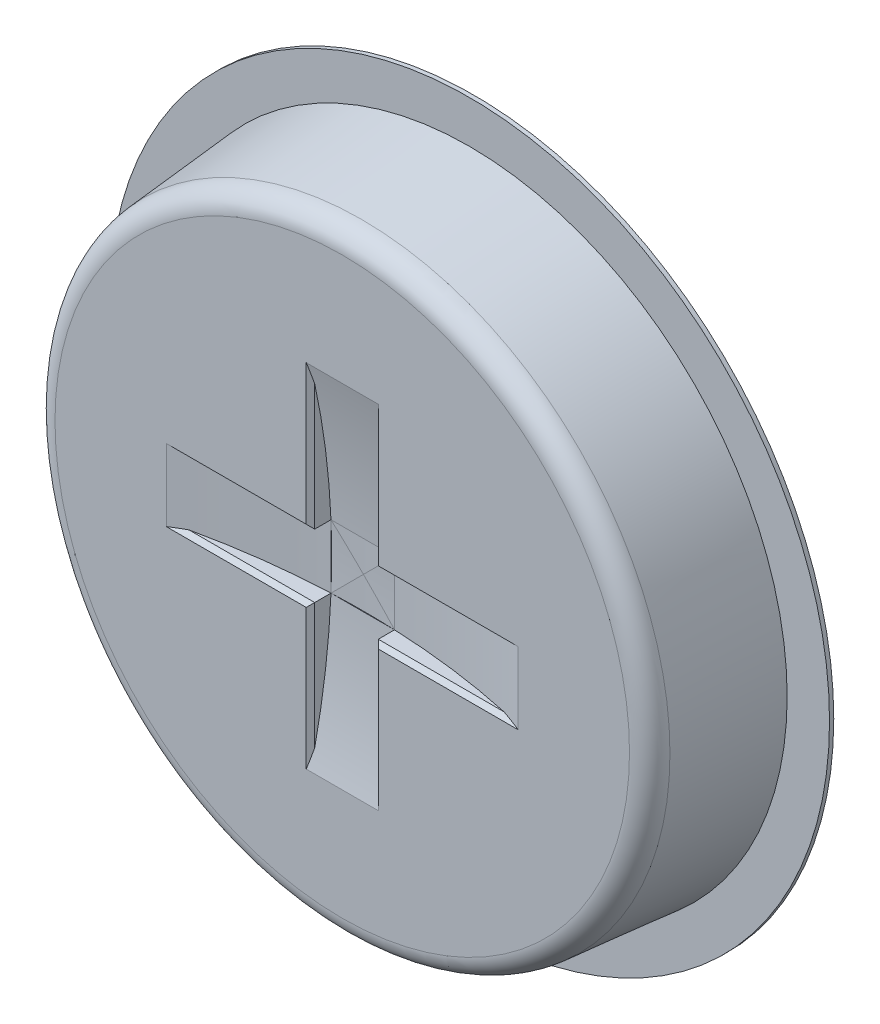
ISO-10303-21;
HEADER;
FILE_DESCRIPTION(('STEP AP214'),'2;1');
FILE_NAME('part.step','',(''),(''),'','','');
FILE_SCHEMA(('AUTOMOTIVE_DESIGN { 1 0 10303 214 1 1 1 1 }'));
ENDSEC;
DATA;
#1=APPLICATION_CONTEXT('core data for automotive mechanical design processes');
#2=APPLICATION_PROTOCOL_DEFINITION('international standard','automotive_design',2000,#1);
#3=PRODUCT_CONTEXT('',#1,'mechanical');
#4=PRODUCT('Part','Part','',(#3));
#5=PRODUCT_RELATED_PRODUCT_CATEGORY('part','',(#4));
#6=PRODUCT_DEFINITION_FORMATION('','',#4);
#7=PRODUCT_DEFINITION_CONTEXT('part definition',#1,'design');
#8=PRODUCT_DEFINITION('design','',#6,#7);
#9=PRODUCT_DEFINITION_SHAPE('','',#8);
#10=(LENGTH_UNIT() NAMED_UNIT(*) SI_UNIT(.MILLI.,.METRE.));
#11=(NAMED_UNIT(*) PLANE_ANGLE_UNIT() SI_UNIT($,.RADIAN.));
#12=(NAMED_UNIT(*) SI_UNIT($,.STERADIAN.) SOLID_ANGLE_UNIT());
#13=UNCERTAINTY_MEASURE_WITH_UNIT(LENGTH_MEASURE(1.E-05),#10,'distance_accuracy_value','');
#14=(GEOMETRIC_REPRESENTATION_CONTEXT(3) GLOBAL_UNCERTAINTY_ASSIGNED_CONTEXT((#13)) GLOBAL_UNIT_ASSIGNED_CONTEXT((#10,
#11,#12)) REPRESENTATION_CONTEXT('',''));
#15=CARTESIAN_POINT('',(0.,0.,0.));
#16=DIRECTION('',(0.,0.,1.));
#17=DIRECTION('',(1.,0.,0.));
#18=AXIS2_PLACEMENT_3D('',#15,#16,#17);
#19=CARTESIAN_POINT('',(0.,0.,60.));
#20=DIRECTION('',(0.,0.,1.));
#21=DIRECTION('',(1.,0.,0.));
#22=AXIS2_PLACEMENT_3D('',#19,#20,#21);
#23=PLANE('',#22);
#24=CARTESIAN_POINT('',(0.,0.,60.));
#25=DIRECTION('',(0.,0.,1.));
#26=DIRECTION('',(1.,0.,0.));
#27=AXIS2_PLACEMENT_3D('',#24,#25,#26);
#28=CIRCLE('',#27,135.58736844827);
#29=CARTESIAN_POINT('',(135.58736844827,0.,60.));
#30=VERTEX_POINT('',#29);
#31=EDGE_CURVE('E215',#30,#30,#28,.T.);
#32=ORIENTED_EDGE('',*,*,#31,.T.);
#33=EDGE_LOOP('',(#32));
#34=FACE_BOUND('',#33,.T.);
#35=DIRECTION('',(-1.,0.,0.));
#36=VECTOR('',#35,1.);
#37=CARTESIAN_POINT('',(15.0000000000003,-83.0662386291807,60.));
#38=LINE('',#37,#36);
#39=CARTESIAN_POINT('',(-16.9999999999997,-83.0662386291808,60.));
#40=VERTEX_POINT('',#39);
#41=CARTESIAN_POINT('',(17.0000000000003,-83.0662386291807,60.));
#42=VERTEX_POINT('',#41);
#43=EDGE_CURVE('E314',#40,#42,#38,.F.);
#44=ORIENTED_EDGE('',*,*,#43,.F.);
#45=DIRECTION('',(0.,1.,0.));
#46=VECTOR('',#45,1.);
#47=CARTESIAN_POINT('',(-17.,-15.,60.));
#48=LINE('',#47,#46);
#49=CARTESIAN_POINT('',(-16.9999999999999,-17.,60.));
#50=VERTEX_POINT('',#49);
#51=EDGE_CURVE('E246',#40,#50,#48,.T.);
#52=ORIENTED_EDGE('',*,*,#51,.T.);
#53=DIRECTION('',(-1.,0.,0.));
#54=VECTOR('',#53,1.);
#55=CARTESIAN_POINT('',(0.,-17.,60.));
#56=LINE('',#55,#54);
#57=CARTESIAN_POINT('',(-83.0662386291808,-17.,60.));
#58=VERTEX_POINT('',#57);
#59=EDGE_CURVE('E243',#50,#58,#56,.T.);
#60=ORIENTED_EDGE('',*,*,#59,.T.);
#61=DIRECTION('',(0.,1.,0.));
#62=VECTOR('',#61,1.);
#63=CARTESIAN_POINT('',(-83.0662386291808,-15.,60.));
#64=LINE('',#63,#62);
#65=CARTESIAN_POINT('',(-83.0662386291808,17.,60.));
#66=VERTEX_POINT('',#65);
#67=EDGE_CURVE('E318',#66,#58,#64,.F.);
#68=ORIENTED_EDGE('',*,*,#67,.F.);
#69=DIRECTION('',(1.,0.,0.));
#70=VECTOR('',#69,1.);
#71=CARTESIAN_POINT('',(-15.0000000000001,17.,60.));
#72=LINE('',#71,#70);
#73=CARTESIAN_POINT('',(-17.0000000000001,17.,60.));
#74=VERTEX_POINT('',#73);
#75=EDGE_CURVE('E241',#66,#74,#72,.T.);
#76=ORIENTED_EDGE('',*,*,#75,.T.);
#77=DIRECTION('',(0.,1.,0.));
#78=VECTOR('',#77,1.);
#79=CARTESIAN_POINT('',(-17.0000000000003,83.0662386291807,60.));
#80=LINE('',#79,#78);
#81=CARTESIAN_POINT('',(-17.0000000000003,83.0662386291807,60.));
#82=VERTEX_POINT('',#81);
#83=EDGE_CURVE('E238',#74,#82,#80,.T.);
#84=ORIENTED_EDGE('',*,*,#83,.T.);
#85=DIRECTION('',(-1.,0.,0.));
#86=VECTOR('',#85,1.);
#87=CARTESIAN_POINT('',(14.9999999999997,83.0662386291808,60.));
#88=LINE('',#87,#86);
#89=CARTESIAN_POINT('',(16.9999999999997,83.0662386291808,60.));
#90=VERTEX_POINT('',#89);
#91=EDGE_CURVE('E170',#90,#82,#88,.T.);
#92=ORIENTED_EDGE('',*,*,#91,.F.);
#93=DIRECTION('',(0.,-1.,0.));
#94=VECTOR('',#93,1.);
#95=CARTESIAN_POINT('',(17.,0.,60.));
#96=LINE('',#95,#94);
#97=CARTESIAN_POINT('',(16.9999999999999,17.,60.));
#98=VERTEX_POINT('',#97);
#99=EDGE_CURVE('E235',#90,#98,#96,.T.);
#100=ORIENTED_EDGE('',*,*,#99,.T.);
#101=DIRECTION('',(1.,0.,0.));
#102=VECTOR('',#101,1.);
#103=CARTESIAN_POINT('',(83.0662386291808,17.,60.));
#104=LINE('',#103,#102);
#105=CARTESIAN_POINT('',(83.0662386291808,17.,60.));
#106=VERTEX_POINT('',#105);
#107=EDGE_CURVE('E232',#98,#106,#104,.T.);
#108=ORIENTED_EDGE('',*,*,#107,.T.);
#109=DIRECTION('',(0.,1.,0.));
#110=VECTOR('',#109,1.);
#111=CARTESIAN_POINT('',(83.0662386291808,-15.,60.));
#112=LINE('',#111,#110);
#113=CARTESIAN_POINT('',(83.0662386291808,-17.,60.));
#114=VERTEX_POINT('',#113);
#115=EDGE_CURVE('E189',#114,#106,#112,.T.);
#116=ORIENTED_EDGE('',*,*,#115,.F.);
#117=DIRECTION('',(-1.,0.,0.));
#118=VECTOR('',#117,1.);
#119=CARTESIAN_POINT('',(0.,-17.,60.));
#120=LINE('',#119,#118);
#121=CARTESIAN_POINT('',(17.0000000000001,-17.,60.));
#122=VERTEX_POINT('',#121);
#123=EDGE_CURVE('E227',#114,#122,#120,.T.);
#124=ORIENTED_EDGE('',*,*,#123,.T.);
#125=DIRECTION('',(0.,-1.,0.));
#126=VECTOR('',#125,1.);
#127=CARTESIAN_POINT('',(17.,0.,60.));
#128=LINE('',#127,#126);
#129=EDGE_CURVE('E229',#122,#42,#128,.T.);
#130=ORIENTED_EDGE('',*,*,#129,.T.);
#131=EDGE_LOOP('',(#44,#52,#60,#68,#76,#84,#92,#100,#108,#116,#124,#130));
#132=FACE_BOUND('',#131,.T.);
#133=ADVANCED_FACE('F33',(#34,#132),#23,.T.);
#134=CARTESIAN_POINT('',(0.,-15.,400.));
#135=DIRECTION('',(0.,1.,0.));
#136=DIRECTION('',(0.,0.,1.));
#137=AXIS2_PLACEMENT_3D('',#134,#135,#136);
#138=CYLINDRICAL_SURFACE('',#137,350.);
#139=DIRECTION('',(0.,1.,0.));
#140=VECTOR('',#139,1.);
#141=CARTESIAN_POINT('',(15.0000000000001,-14.9999999999999,50.3215763018828));
#142=LINE('',#141,#140);
#143=CARTESIAN_POINT('',(15.0000000000001,-15.,50.3215763018828));
#144=VERTEX_POINT('',#143);
#145=CARTESIAN_POINT('',(14.9999999999999,15.,50.3215763018828));
#146=VERTEX_POINT('',#145);
#147=EDGE_CURVE('E305',#144,#146,#142,.T.);
#148=ORIENTED_EDGE('',*,*,#147,.F.);
#149=CARTESIAN_POINT('',(0.,-15.,400.));
#150=DIRECTION('',(0.,1.,0.));
#151=DIRECTION('',(0.,0.,1.));
#152=AXIS2_PLACEMENT_3D('',#149,#150,#151);
#153=CIRCLE('',#152,350.);
#154=CARTESIAN_POINT('',(74.4043009509531,-15.,58.));
#155=VERTEX_POINT('',#154);
#156=EDGE_CURVE('E317',#155,#144,#153,.T.);
#157=ORIENTED_EDGE('',*,*,#156,.F.);
#158=CARTESIAN_POINT('',(0.,-357.,400.));
#159=DIRECTION('',(0.,-0.707106781186547,-0.707106781186547));
#160=DIRECTION('',(0.,0.707106781186548,-0.707106781186548));
#161=AXIS2_PLACEMENT_3D('',#158,#159,#160);
#162=ELLIPSE('',#161,494.974746830583,350.);
#163=EDGE_CURVE('E11',#155,#114,#162,.T.);
#164=ORIENTED_EDGE('',*,*,#163,.T.);
#165=ORIENTED_EDGE('',*,*,#115,.T.);
#166=CARTESIAN_POINT('',(0.,357.,400.));
#167=DIRECTION('',(0.,-0.707106781186547,0.707106781186547));
#168=DIRECTION('',(0.,0.707106781186548,0.707106781186548));
#169=AXIS2_PLACEMENT_3D('',#166,#167,#168);
#170=ELLIPSE('',#169,494.974746830583,350.);
#171=CARTESIAN_POINT('',(74.4043009509531,15.,58.));
#172=VERTEX_POINT('',#171);
#173=EDGE_CURVE('E270',#106,#172,#170,.F.);
#174=ORIENTED_EDGE('',*,*,#173,.T.);
#175=CARTESIAN_POINT('',(0.,15.,400.));
#176=DIRECTION('',(0.,1.,0.));
#177=DIRECTION('',(0.,0.,1.));
#178=AXIS2_PLACEMENT_3D('',#175,#176,#177);
#179=CIRCLE('',#178,350.);
#180=EDGE_CURVE('E172',#172,#146,#179,.T.);
#181=ORIENTED_EDGE('',*,*,#180,.T.);
#182=EDGE_LOOP('',(#148,#157,#164,#165,#174,#181));
#183=FACE_BOUND('',#182,.T.);
#184=ADVANCED_FACE('F323',(#183),#138,.F.);
#185=CARTESIAN_POINT('',(0.,-15.,400.));
#186=DIRECTION('',(0.,1.,0.));
#187=DIRECTION('',(0.,0.,1.));
#188=AXIS2_PLACEMENT_3D('',#185,#186,#187);
#189=PLANE('',#188);
#190=DIRECTION('',(0.,0.,1.));
#191=VECTOR('',#190,1.);
#192=CARTESIAN_POINT('',(15.0000000000001,-15.,400.));
#193=LINE('',#192,#191);
#194=CARTESIAN_POINT('',(15.0000000000001,-15.,58.));
#195=VERTEX_POINT('',#194);
#196=EDGE_CURVE('E204',#144,#195,#193,.T.);
#197=ORIENTED_EDGE('',*,*,#196,.T.);
#198=DIRECTION('',(1.,0.,0.));
#199=VECTOR('',#198,1.);
#200=CARTESIAN_POINT('',(0.,-15.,58.));
#201=LINE('',#200,#199);
#202=EDGE_CURVE('E50',#195,#155,#201,.T.);
#203=ORIENTED_EDGE('',*,*,#202,.T.);
#204=ORIENTED_EDGE('',*,*,#156,.T.);
#205=EDGE_LOOP('',(#197,#203,#204));
#206=FACE_BOUND('',#205,.T.);
#207=ADVANCED_FACE('F390',(#206),#189,.T.);
#208=CARTESIAN_POINT('',(0.,15.,400.));
#209=DIRECTION('',(0.,1.,0.));
#210=DIRECTION('',(0.,0.,1.));
#211=AXIS2_PLACEMENT_3D('',#208,#209,#210);
#212=PLANE('',#211);
#213=ORIENTED_EDGE('',*,*,#180,.F.);
#214=DIRECTION('',(-1.,0.,0.));
#215=VECTOR('',#214,1.);
#216=CARTESIAN_POINT('',(14.9999999999999,15.,58.));
#217=LINE('',#216,#215);
#218=CARTESIAN_POINT('',(14.9999999999999,15.,58.));
#219=VERTEX_POINT('',#218);
#220=EDGE_CURVE('E254',#172,#219,#217,.T.);
#221=ORIENTED_EDGE('',*,*,#220,.T.);
#222=DIRECTION('',(0.,0.,1.));
#223=VECTOR('',#222,1.);
#224=CARTESIAN_POINT('',(14.9999999999999,15.,400.));
#225=LINE('',#224,#223);
#226=EDGE_CURVE('E212',#146,#219,#225,.T.);
#227=ORIENTED_EDGE('',*,*,#226,.F.);
#228=EDGE_LOOP('',(#213,#221,#227));
#229=FACE_BOUND('',#228,.T.);
#230=ADVANCED_FACE('F334',(#229),#212,.F.);
#231=CARTESIAN_POINT('',(0.,0.,0.));
#232=DIRECTION('',(0.,0.,-1.));
#233=DIRECTION('',(1.,0.,0.));
#234=AXIS2_PLACEMENT_3D('',#231,#232,#233);
#235=CONICAL_SURFACE('',#234,150.,0.0872664625997167);
#236=CARTESIAN_POINT('',(0.,0.,50.8715574274766));
#237=DIRECTION('',(0.,0.,-1.));
#238=DIRECTION('',(-1.,0.,0.));
#239=AXIS2_PLACEMENT_3D('',#236,#237,#238);
#240=CIRCLE('',#239,145.549315429188);
#241=CARTESIAN_POINT('',(-145.549315429188,0.,50.8715574274766));
#242=VERTEX_POINT('',#241);
#243=EDGE_CURVE('E221',#242,#242,#240,.T.);
#244=ORIENTED_EDGE('',*,*,#243,.T.);
#245=EDGE_LOOP('',(#244));
#246=FACE_BOUND('',#245,.T.);
#247=CARTESIAN_POINT('',(0.,0.,0.));
#248=DIRECTION('',(0.,0.,-1.));
#249=DIRECTION('',(-1.,0.,0.));
#250=AXIS2_PLACEMENT_3D('',#247,#248,#249);
#251=CIRCLE('',#250,150.);
#252=CARTESIAN_POINT('',(-150.,0.,0.));
#253=VERTEX_POINT('',#252);
#254=EDGE_CURVE('E285',#253,#253,#251,.T.);
#255=ORIENTED_EDGE('',*,*,#254,.F.);
#256=EDGE_LOOP('',(#255));
#257=FACE_BOUND('',#256,.T.);
#258=ADVANCED_FACE('F394',(#246,#257),#235,.T.);
#259=CARTESIAN_POINT('',(-14.9999999999999,-15.,50.3215763018828));
#260=VERTEX_POINT('',#259);
#261=CARTESIAN_POINT('',(-74.4043009509531,-15.,58.));
#262=VERTEX_POINT('',#261);
#263=EDGE_CURVE('E178',#260,#262,#153,.T.);
#264=ORIENTED_EDGE('',*,*,#263,.F.);
#265=DIRECTION('',(0.,1.,0.));
#266=VECTOR('',#265,1.);
#267=CARTESIAN_POINT('',(-14.9999999999999,-15.0000000000001,50.3215763018828));
#268=LINE('',#267,#266);
#269=CARTESIAN_POINT('',(-15.0000000000001,15.,50.3215763018828));
#270=VERTEX_POINT('',#269);
#271=EDGE_CURVE('E175',#260,#270,#268,.T.);
#272=ORIENTED_EDGE('',*,*,#271,.T.);
#273=CARTESIAN_POINT('',(-74.4043009509531,15.,58.));
#274=VERTEX_POINT('',#273);
#275=EDGE_CURVE('E160',#270,#274,#179,.T.);
#276=ORIENTED_EDGE('',*,*,#275,.T.);
#277=CARTESIAN_POINT('',(0.,357.,400.));
#278=DIRECTION('',(0.,-0.707106781186547,0.707106781186547));
#279=DIRECTION('',(0.,0.707106781186548,0.707106781186548));
#280=AXIS2_PLACEMENT_3D('',#277,#278,#279);
#281=ELLIPSE('',#280,494.974746830583,350.);
#282=EDGE_CURVE('E264',#274,#66,#281,.F.);
#283=ORIENTED_EDGE('',*,*,#282,.T.);
#284=ORIENTED_EDGE('',*,*,#67,.T.);
#285=CARTESIAN_POINT('',(0.,-357.,400.));
#286=DIRECTION('',(0.,-0.707106781186547,-0.707106781186547));
#287=DIRECTION('',(0.,0.707106781186548,-0.707106781186548));
#288=AXIS2_PLACEMENT_3D('',#285,#286,#287);
#289=ELLIPSE('',#288,494.974746830583,350.);
#290=EDGE_CURVE('E262',#58,#262,#289,.T.);
#291=ORIENTED_EDGE('',*,*,#290,.T.);
#292=EDGE_LOOP('',(#264,#272,#276,#283,#284,#291));
#293=FACE_BOUND('',#292,.T.);
#294=ADVANCED_FACE('F176',(#293),#138,.F.);
#295=ORIENTED_EDGE('',*,*,#263,.T.);
#296=DIRECTION('',(1.,0.,0.));
#297=VECTOR('',#296,1.);
#298=CARTESIAN_POINT('',(0.,-15.,58.));
#299=LINE('',#298,#297);
#300=CARTESIAN_POINT('',(-14.9999999999999,-15.,58.));
#301=VERTEX_POINT('',#300);
#302=EDGE_CURVE('E248',#262,#301,#299,.T.);
#303=ORIENTED_EDGE('',*,*,#302,.T.);
#304=DIRECTION('',(0.,0.,1.));
#305=VECTOR('',#304,1.);
#306=CARTESIAN_POINT('',(-14.9999999999999,-15.,400.));
#307=LINE('',#306,#305);
#308=EDGE_CURVE('E183',#260,#301,#307,.T.);
#309=ORIENTED_EDGE('',*,*,#308,.F.);
#310=EDGE_LOOP('',(#295,#303,#309));
#311=FACE_BOUND('',#310,.T.);
#312=ADVANCED_FACE('F354',(#311),#189,.T.);
#313=DIRECTION('',(0.,0.,1.));
#314=VECTOR('',#313,1.);
#315=CARTESIAN_POINT('',(-15.0000000000001,15.,400.));
#316=LINE('',#315,#314);
#317=CARTESIAN_POINT('',(-15.0000000000001,15.,58.));
#318=VERTEX_POINT('',#317);
#319=EDGE_CURVE('E163',#270,#318,#316,.T.);
#320=ORIENTED_EDGE('',*,*,#319,.T.);
#321=DIRECTION('',(-1.,0.,0.));
#322=VECTOR('',#321,1.);
#323=CARTESIAN_POINT('',(-83.0662386291808,15.,58.));
#324=LINE('',#323,#322);
#325=EDGE_CURVE('E166',#318,#274,#324,.T.);
#326=ORIENTED_EDGE('',*,*,#325,.T.);
#327=ORIENTED_EDGE('',*,*,#275,.F.);
#328=EDGE_LOOP('',(#320,#326,#327));
#329=FACE_BOUND('',#328,.T.);
#330=ADVANCED_FACE('F162',(#329),#212,.F.);
#331=CARTESIAN_POINT('',(-15.,0.,400.));
#332=DIRECTION('',(-1.,0.,0.));
#333=DIRECTION('',(0.,0.,1.));
#334=AXIS2_PLACEMENT_3D('',#331,#332,#333);
#335=PLANE('',#334);
#336=CARTESIAN_POINT('',(-15.,0.,400.));
#337=DIRECTION('',(-1.,0.,0.));
#338=DIRECTION('',(0.,0.,1.));
#339=AXIS2_PLACEMENT_3D('',#336,#337,#338);
#340=CIRCLE('',#339,350.);
#341=CARTESIAN_POINT('',(-15.0000000000003,74.404300950953,58.));
#342=VERTEX_POINT('',#341);
#343=EDGE_CURVE('E140',#342,#270,#340,.T.);
#344=ORIENTED_EDGE('',*,*,#343,.F.);
#345=DIRECTION('',(0.,-1.,0.));
#346=VECTOR('',#345,1.);
#347=CARTESIAN_POINT('',(-15.0000000000001,15.,58.));
#348=LINE('',#347,#346);
#349=EDGE_CURVE('E188',#342,#318,#348,.T.);
#350=ORIENTED_EDGE('',*,*,#349,.T.);
#351=ORIENTED_EDGE('',*,*,#319,.F.);
#352=EDGE_LOOP('',(#344,#350,#351));
#353=FACE_BOUND('',#352,.T.);
#354=ADVANCED_FACE('F187',(#353),#335,.F.);
#355=CARTESIAN_POINT('',(15.,0.,400.));
#356=DIRECTION('',(-1.,0.,0.));
#357=DIRECTION('',(0.,0.,1.));
#358=AXIS2_PLACEMENT_3D('',#355,#356,#357);
#359=PLANE('',#358);
#360=ORIENTED_EDGE('',*,*,#226,.T.);
#361=DIRECTION('',(0.,1.,0.));
#362=VECTOR('',#361,1.);
#363=CARTESIAN_POINT('',(15.,0.,58.));
#364=LINE('',#363,#362);
#365=CARTESIAN_POINT('',(14.9999999999997,74.4043009509531,58.));
#366=VERTEX_POINT('',#365);
#367=EDGE_CURVE('E252',#219,#366,#364,.T.);
#368=ORIENTED_EDGE('',*,*,#367,.T.);
#369=CARTESIAN_POINT('',(15.,0.,400.));
#370=DIRECTION('',(-1.,0.,0.));
#371=DIRECTION('',(0.,0.,1.));
#372=AXIS2_PLACEMENT_3D('',#369,#370,#371);
#373=CIRCLE('',#372,350.);
#374=EDGE_CURVE('E184',#366,#146,#373,.T.);
#375=ORIENTED_EDGE('',*,*,#374,.T.);
#376=EDGE_LOOP('',(#360,#368,#375));
#377=FACE_BOUND('',#376,.T.);
#378=ADVANCED_FACE('F336',(#377),#359,.T.);
#379=CARTESIAN_POINT('',(15.,0.,400.));
#380=DIRECTION('',(-1.,0.,0.));
#381=DIRECTION('',(0.,-1.,0.));
#382=AXIS2_PLACEMENT_3D('',#379,#380,#381);
#383=CYLINDRICAL_SURFACE('',#382,350.);
#384=ORIENTED_EDGE('',*,*,#91,.T.);
#385=CARTESIAN_POINT('',(-357.,-1.246458837967E-12,400.));
#386=DIRECTION('',(0.707106781186547,0.,0.707106781186547));
#387=DIRECTION('',(-0.707106781186548,0.,0.707106781186548));
#388=AXIS2_PLACEMENT_3D('',#385,#386,#387);
#389=ELLIPSE('',#388,494.974746830583,350.);
#390=EDGE_CURVE('E148',#82,#342,#389,.F.);
#391=ORIENTED_EDGE('',*,*,#390,.T.);
#392=ORIENTED_EDGE('',*,*,#343,.T.);
#393=DIRECTION('',(-1.,0.,0.));
#394=VECTOR('',#393,1.);
#395=CARTESIAN_POINT('',(15.,15.,50.3215763018828));
#396=LINE('',#395,#394);
#397=EDGE_CURVE('E145',#146,#270,#396,.T.);
#398=ORIENTED_EDGE('',*,*,#397,.F.);
#399=ORIENTED_EDGE('',*,*,#374,.F.);
#400=CARTESIAN_POINT('',(357.,1.246458837967E-12,400.));
#401=DIRECTION('',(0.707106781186547,0.,-0.707106781186547));
#402=DIRECTION('',(-0.707106781186548,0.,-0.707106781186548));
#403=AXIS2_PLACEMENT_3D('',#400,#401,#402);
#404=ELLIPSE('',#403,494.974746830583,350.);
#405=EDGE_CURVE('E267',#366,#90,#404,.T.);
#406=ORIENTED_EDGE('',*,*,#405,.T.);
#407=EDGE_LOOP('',(#384,#391,#392,#398,#399,#406));
#408=FACE_BOUND('',#407,.T.);
#409=ADVANCED_FACE('F142',(#408),#383,.F.);
#410=EDGE_CURVE('E169',#146,#270,#179,.T.);
#411=ORIENTED_EDGE('',*,*,#410,.F.);
#412=ORIENTED_EDGE('',*,*,#397,.T.);
#413=EDGE_LOOP('',(#411,#412));
#414=FACE_BOUND('',#413,.T.);
#415=ADVANCED_FACE('F211',(#414),#212,.F.);
#416=CARTESIAN_POINT('',(0.,0.,400.));
#417=DIRECTION('',(0.707106781186546,0.707106781186549,0.));
#418=DIRECTION('',(-0.707106781186549,0.707106781186546,0.));
#419=AXIS2_PLACEMENT_3D('',#416,#417,#418);
#420=ELLIPSE('',#419,494.974746830582,350.);
#421=CARTESIAN_POINT('',(0.,0.,50.));
#422=VERTEX_POINT('',#421);
#423=EDGE_CURVE('E193',#270,#422,#420,.F.);
#424=ORIENTED_EDGE('',*,*,#423,.T.);
#425=CARTESIAN_POINT('',(0.,0.,400.));
#426=DIRECTION('',(-0.707106781186549,0.707106781186546,0.));
#427=DIRECTION('',(0.707106781186546,0.707106781186549,0.));
#428=AXIS2_PLACEMENT_3D('',#425,#426,#427);
#429=ELLIPSE('',#428,494.974746830584,350.);
#430=EDGE_CURVE('E209',#422,#146,#429,.F.);
#431=ORIENTED_EDGE('',*,*,#430,.T.);
#432=ORIENTED_EDGE('',*,*,#410,.T.);
#433=EDGE_LOOP('',(#424,#431,#432));
#434=FACE_BOUND('',#433,.T.);
#435=ADVANCED_FACE('F208',(#434),#138,.F.);
#436=CARTESIAN_POINT('',(15.0000000000003,-74.404300950953,58.));
#437=VERTEX_POINT('',#436);
#438=EDGE_CURVE('E152',#144,#437,#373,.T.);
#439=ORIENTED_EDGE('',*,*,#438,.T.);
#440=DIRECTION('',(0.,1.,0.));
#441=VECTOR('',#440,1.);
#442=CARTESIAN_POINT('',(15.,0.,58.));
#443=LINE('',#442,#441);
#444=EDGE_CURVE('E256',#437,#195,#443,.T.);
#445=ORIENTED_EDGE('',*,*,#444,.T.);
#446=ORIENTED_EDGE('',*,*,#196,.F.);
#447=EDGE_LOOP('',(#439,#445,#446));
#448=FACE_BOUND('',#447,.T.);
#449=ADVANCED_FACE('F374',(#448),#359,.T.);
#450=ORIENTED_EDGE('',*,*,#308,.T.);
#451=DIRECTION('',(0.,-1.,0.));
#452=VECTOR('',#451,1.);
#453=CARTESIAN_POINT('',(-14.9999999999997,-83.0662386291808,58.));
#454=LINE('',#453,#452);
#455=CARTESIAN_POINT('',(-14.9999999999997,-74.4043009509531,58.));
#456=VERTEX_POINT('',#455);
#457=EDGE_CURVE('E224',#301,#456,#454,.T.);
#458=ORIENTED_EDGE('',*,*,#457,.T.);
#459=EDGE_CURVE('E155',#260,#456,#340,.T.);
#460=ORIENTED_EDGE('',*,*,#459,.F.);
#461=EDGE_LOOP('',(#450,#458,#460));
#462=FACE_BOUND('',#461,.T.);
#463=ADVANCED_FACE('F356',(#462),#335,.F.);
#464=ORIENTED_EDGE('',*,*,#43,.T.);
#465=CARTESIAN_POINT('',(357.,1.246458837967E-12,400.));
#466=DIRECTION('',(0.707106781186547,0.,-0.707106781186547));
#467=DIRECTION('',(-0.707106781186548,0.,-0.707106781186548));
#468=AXIS2_PLACEMENT_3D('',#465,#466,#467);
#469=ELLIPSE('',#468,494.974746830583,350.);
#470=EDGE_CURVE('E42',#42,#437,#469,.T.);
#471=ORIENTED_EDGE('',*,*,#470,.T.);
#472=ORIENTED_EDGE('',*,*,#438,.F.);
#473=DIRECTION('',(-1.,0.,0.));
#474=VECTOR('',#473,1.);
#475=CARTESIAN_POINT('',(15.,-15.,50.3215763018828));
#476=LINE('',#475,#474);
#477=EDGE_CURVE('E310',#144,#260,#476,.T.);
#478=ORIENTED_EDGE('',*,*,#477,.T.);
#479=ORIENTED_EDGE('',*,*,#459,.T.);
#480=CARTESIAN_POINT('',(-357.,-1.246458837967E-12,400.));
#481=DIRECTION('',(0.707106781186547,0.,0.707106781186547));
#482=DIRECTION('',(-0.707106781186548,0.,0.707106781186548));
#483=AXIS2_PLACEMENT_3D('',#480,#481,#482);
#484=ELLIPSE('',#483,494.974746830583,350.);
#485=EDGE_CURVE('E259',#456,#40,#484,.F.);
#486=ORIENTED_EDGE('',*,*,#485,.T.);
#487=EDGE_LOOP('',(#464,#471,#472,#478,#479,#486));
#488=FACE_BOUND('',#487,.T.);
#489=ADVANCED_FACE('F359',(#488),#383,.F.);
#490=ORIENTED_EDGE('',*,*,#477,.F.);
#491=EDGE_CURVE('E319',#144,#260,#153,.T.);
#492=ORIENTED_EDGE('',*,*,#491,.T.);
#493=EDGE_LOOP('',(#490,#492));
#494=FACE_BOUND('',#493,.T.);
#495=ADVANCED_FACE('F362',(#494),#189,.T.);
#496=CARTESIAN_POINT('',(0.,0.,400.));
#497=DIRECTION('',(0.707106781186546,0.707106781186549,0.));
#498=DIRECTION('',(-0.707106781186549,0.707106781186546,0.));
#499=AXIS2_PLACEMENT_3D('',#496,#497,#498);
#500=ELLIPSE('',#499,494.974746830582,350.);
#501=EDGE_CURVE('E203',#144,#422,#500,.T.);
#502=ORIENTED_EDGE('',*,*,#501,.T.);
#503=CARTESIAN_POINT('',(0.,0.,400.));
#504=DIRECTION('',(-0.707106781186549,0.707106781186546,0.));
#505=DIRECTION('',(0.707106781186546,0.707106781186549,0.));
#506=AXIS2_PLACEMENT_3D('',#503,#504,#505);
#507=ELLIPSE('',#506,494.974746830584,350.);
#508=EDGE_CURVE('E197',#422,#260,#507,.T.);
#509=ORIENTED_EDGE('',*,*,#508,.T.);
#510=ORIENTED_EDGE('',*,*,#491,.F.);
#511=EDGE_LOOP('',(#502,#509,#510));
#512=FACE_BOUND('',#511,.T.);
#513=ADVANCED_FACE('F365',(#512),#138,.F.);
#514=EDGE_CURVE('E153',#270,#260,#340,.T.);
#515=ORIENTED_EDGE('',*,*,#514,.F.);
#516=ORIENTED_EDGE('',*,*,#271,.F.);
#517=EDGE_LOOP('',(#515,#516));
#518=FACE_BOUND('',#517,.T.);
#519=ADVANCED_FACE('F206',(#518),#335,.F.);
#520=ORIENTED_EDGE('',*,*,#423,.F.);
#521=ORIENTED_EDGE('',*,*,#514,.T.);
#522=ORIENTED_EDGE('',*,*,#508,.F.);
#523=EDGE_LOOP('',(#520,#521,#522));
#524=FACE_BOUND('',#523,.T.);
#525=ADVANCED_FACE('F194',(#524),#383,.F.);
#526=ORIENTED_EDGE('',*,*,#501,.F.);
#527=EDGE_CURVE('E301',#146,#144,#373,.T.);
#528=ORIENTED_EDGE('',*,*,#527,.F.);
#529=ORIENTED_EDGE('',*,*,#430,.F.);
#530=EDGE_LOOP('',(#526,#528,#529));
#531=FACE_BOUND('',#530,.T.);
#532=ADVANCED_FACE('F370',(#531),#383,.F.);
#533=ORIENTED_EDGE('',*,*,#147,.T.);
#534=ORIENTED_EDGE('',*,*,#527,.T.);
#535=EDGE_LOOP('',(#533,#534));
#536=FACE_BOUND('',#535,.T.);
#537=ADVANCED_FACE('F372',(#536),#359,.T.);
#538=CARTESIAN_POINT('',(0.,0.,50.));
#539=DIRECTION('',(0.,0.,1.));
#540=DIRECTION('',(1.,0.,0.));
#541=AXIS2_PLACEMENT_3D('',#538,#539,#540);
#542=TOROIDAL_SURFACE('',#541,135.58736844827,10.);
#543=ORIENTED_EDGE('',*,*,#243,.F.);
#544=EDGE_LOOP('',(#543));
#545=FACE_BOUND('',#544,.T.);
#546=ORIENTED_EDGE('',*,*,#31,.F.);
#547=EDGE_LOOP('',(#546));
#548=FACE_BOUND('',#547,.T.);
#549=ADVANCED_FACE('F398',(#545,#548),#542,.T.);
#550=CARTESIAN_POINT('',(0.,-17.,60.));
#551=DIRECTION('',(0.,-0.707106781186547,-0.707106781186547));
#552=DIRECTION('',(-1.,0.,0.));
#553=AXIS2_PLACEMENT_3D('',#550,#551,#552);
#554=PLANE('',#553);
#555=ORIENTED_EDGE('',*,*,#290,.F.);
#556=ORIENTED_EDGE('',*,*,#59,.F.);
#557=DIRECTION('',(-0.577350269189624,-0.577350269189626,0.577350269189626));
#558=VECTOR('',#557,1.);
#559=CARTESIAN_POINT('',(-11.3333333333333,-11.3333333333334,54.3333333333334));
#560=LINE('',#559,#558);
#561=EDGE_CURVE('E273',#301,#50,#560,.T.);
#562=ORIENTED_EDGE('',*,*,#561,.F.);
#563=ORIENTED_EDGE('',*,*,#302,.F.);
#564=EDGE_LOOP('',(#555,#556,#562,#563));
#565=FACE_BOUND('',#564,.T.);
#566=ADVANCED_FACE('F351',(#565),#554,.F.);
#567=CARTESIAN_POINT('',(-15.,0.,58.));
#568=DIRECTION('',(0.707106781186547,0.,0.707106781186547));
#569=DIRECTION('',(0.,1.,0.));
#570=AXIS2_PLACEMENT_3D('',#567,#568,#569);
#571=PLANE('',#570);
#572=ORIENTED_EDGE('',*,*,#561,.T.);
#573=ORIENTED_EDGE('',*,*,#51,.F.);
#574=ORIENTED_EDGE('',*,*,#485,.F.);
#575=ORIENTED_EDGE('',*,*,#457,.F.);
#576=EDGE_LOOP('',(#572,#573,#574,#575));
#577=FACE_BOUND('',#576,.T.);
#578=ADVANCED_FACE('F402',(#577),#571,.T.);
#579=CARTESIAN_POINT('',(-15.,0.,58.));
#580=DIRECTION('',(0.707106781186547,0.,0.707106781186547));
#581=DIRECTION('',(0.,1.,0.));
#582=AXIS2_PLACEMENT_3D('',#579,#580,#581);
#583=PLANE('',#582);
#584=ORIENTED_EDGE('',*,*,#390,.F.);
#585=ORIENTED_EDGE('',*,*,#83,.F.);
#586=DIRECTION('',(0.577350269189627,-0.577350269189625,-0.577350269189625));
#587=VECTOR('',#586,1.);
#588=CARTESIAN_POINT('',(-10.,9.99999999999998,53.));
#589=LINE('',#588,#587);
#590=EDGE_CURVE('E276',#318,#74,#589,.F.);
#591=ORIENTED_EDGE('',*,*,#590,.F.);
#592=ORIENTED_EDGE('',*,*,#349,.F.);
#593=EDGE_LOOP('',(#584,#585,#591,#592));
#594=FACE_BOUND('',#593,.T.);
#595=ADVANCED_FACE('F342',(#594),#583,.T.);
#596=CARTESIAN_POINT('',(0.,15.,58.));
#597=DIRECTION('',(0.,-0.707106781186547,0.707106781186547));
#598=DIRECTION('',(1.,0.,0.));
#599=AXIS2_PLACEMENT_3D('',#596,#597,#598);
#600=PLANE('',#599);
#601=ORIENTED_EDGE('',*,*,#590,.T.);
#602=ORIENTED_EDGE('',*,*,#75,.F.);
#603=ORIENTED_EDGE('',*,*,#282,.F.);
#604=ORIENTED_EDGE('',*,*,#325,.F.);
#605=EDGE_LOOP('',(#601,#602,#603,#604));
#606=FACE_BOUND('',#605,.T.);
#607=ADVANCED_FACE('F344',(#606),#600,.T.);
#608=CARTESIAN_POINT('',(0.,15.,58.));
#609=DIRECTION('',(0.,-0.707106781186547,0.707106781186547));
#610=DIRECTION('',(1.,0.,0.));
#611=AXIS2_PLACEMENT_3D('',#608,#609,#610);
#612=PLANE('',#611);
#613=ORIENTED_EDGE('',*,*,#173,.F.);
#614=ORIENTED_EDGE('',*,*,#107,.F.);
#615=DIRECTION('',(0.577350269189624,0.577350269189626,0.577350269189626));
#616=VECTOR('',#615,1.);
#617=CARTESIAN_POINT('',(9.99999999999999,10.,53.));
#618=LINE('',#617,#616);
#619=EDGE_CURVE('E278',#219,#98,#618,.T.);
#620=ORIENTED_EDGE('',*,*,#619,.F.);
#621=ORIENTED_EDGE('',*,*,#220,.F.);
#622=EDGE_LOOP('',(#613,#614,#620,#621));
#623=FACE_BOUND('',#622,.T.);
#624=ADVANCED_FACE('F331',(#623),#612,.T.);
#625=CARTESIAN_POINT('',(17.,0.,60.));
#626=DIRECTION('',(0.707106781186547,0.,-0.707106781186547));
#627=DIRECTION('',(0.,-1.,0.));
#628=AXIS2_PLACEMENT_3D('',#625,#626,#627);
#629=PLANE('',#628);
#630=ORIENTED_EDGE('',*,*,#405,.F.);
#631=ORIENTED_EDGE('',*,*,#367,.F.);
#632=ORIENTED_EDGE('',*,*,#619,.T.);
#633=ORIENTED_EDGE('',*,*,#99,.F.);
#634=EDGE_LOOP('',(#630,#631,#632,#633));
#635=FACE_BOUND('',#634,.T.);
#636=ADVANCED_FACE('F338',(#635),#629,.F.);
#637=CARTESIAN_POINT('',(0.,-17.,60.));
#638=DIRECTION('',(0.,-0.707106781186547,-0.707106781186547));
#639=DIRECTION('',(-1.,0.,0.));
#640=AXIS2_PLACEMENT_3D('',#637,#638,#639);
#641=PLANE('',#640);
#642=ORIENTED_EDGE('',*,*,#163,.F.);
#643=ORIENTED_EDGE('',*,*,#202,.F.);
#644=DIRECTION('',(0.577350269189627,-0.577350269189625,0.577350269189625));
#645=VECTOR('',#644,1.);
#646=CARTESIAN_POINT('',(11.3333333333333,-11.3333333333333,54.3333333333333));
#647=LINE('',#646,#645);
#648=EDGE_CURVE('E37',#122,#195,#647,.F.);
#649=ORIENTED_EDGE('',*,*,#648,.F.);
#650=ORIENTED_EDGE('',*,*,#123,.F.);
#651=EDGE_LOOP('',(#642,#643,#649,#650));
#652=FACE_BOUND('',#651,.T.);
#653=ADVANCED_FACE('F35',(#652),#641,.F.);
#654=CARTESIAN_POINT('',(17.,0.,60.));
#655=DIRECTION('',(0.707106781186547,0.,-0.707106781186547));
#656=DIRECTION('',(0.,-1.,0.));
#657=AXIS2_PLACEMENT_3D('',#654,#655,#656);
#658=PLANE('',#657);
#659=ORIENTED_EDGE('',*,*,#648,.T.);
#660=ORIENTED_EDGE('',*,*,#444,.F.);
#661=ORIENTED_EDGE('',*,*,#470,.F.);
#662=ORIENTED_EDGE('',*,*,#129,.F.);
#663=EDGE_LOOP('',(#659,#660,#661,#662));
#664=FACE_BOUND('',#663,.T.);
#665=ADVANCED_FACE('F375',(#664),#658,.F.);
#666=CARTESIAN_POINT('',(0.,0.,0.));
#667=DIRECTION('',(0.,0.,-1.));
#668=DIRECTION('',(-1.,0.,0.));
#669=AXIS2_PLACEMENT_3D('',#666,#667,#668);
#670=PLANE('',#669);
#671=CARTESIAN_POINT('',(0.,0.,0.));
#672=DIRECTION('',(0.,0.,-1.));
#673=DIRECTION('',(-1.,0.,0.));
#674=AXIS2_PLACEMENT_3D('',#671,#672,#673);
#675=CIRCLE('',#674,170.);
#676=CARTESIAN_POINT('',(-170.,0.,0.));
#677=VERTEX_POINT('',#676);
#678=EDGE_CURVE('E296',#677,#677,#675,.T.);
#679=ORIENTED_EDGE('',*,*,#678,.F.);
#680=EDGE_LOOP('',(#679));
#681=FACE_BOUND('',#680,.T.);
#682=ORIENTED_EDGE('',*,*,#254,.T.);
#683=EDGE_LOOP('',(#682));
#684=FACE_BOUND('',#683,.T.);
#685=ADVANCED_FACE('F382',(#681,#684),#670,.F.);
#686=CARTESIAN_POINT('',(0.,0.,-2.));
#687=DIRECTION('',(0.,0.,1.));
#688=DIRECTION('',(1.,0.,0.));
#689=AXIS2_PLACEMENT_3D('',#686,#687,#688);
#690=CYLINDRICAL_SURFACE('',#689,170.);
#691=CARTESIAN_POINT('',(0.,0.,-2.));
#692=DIRECTION('',(0.,0.,-1.));
#693=DIRECTION('',(-1.,0.,0.));
#694=AXIS2_PLACEMENT_3D('',#691,#692,#693);
#695=CIRCLE('',#694,170.);
#696=CARTESIAN_POINT('',(-170.,0.,-2.));
#697=VERTEX_POINT('',#696);
#698=EDGE_CURVE('E291',#697,#697,#695,.T.);
#699=ORIENTED_EDGE('',*,*,#698,.F.);
#700=EDGE_LOOP('',(#699));
#701=FACE_BOUND('',#700,.T.);
#702=ORIENTED_EDGE('',*,*,#678,.T.);
#703=EDGE_LOOP('',(#702));
#704=FACE_BOUND('',#703,.T.);
#705=ADVANCED_FACE('F440',(#701,#704),#690,.T.);
#706=CARTESIAN_POINT('',(0.,0.,-2.));
#707=DIRECTION('',(0.,0.,-1.));
#708=DIRECTION('',(-1.,0.,0.));
#709=AXIS2_PLACEMENT_3D('',#706,#707,#708);
#710=PLANE('',#709);
#711=ORIENTED_EDGE('',*,*,#698,.T.);
#712=EDGE_LOOP('',(#711));
#713=FACE_BOUND('',#712,.T.);
#714=ADVANCED_FACE('F450',(#713),#710,.T.);
#715=CLOSED_SHELL('',(#133,#184,#207,#230,#258,#294,#312,#330,#354,#378,#409,#415,#435,#449,
#463,#489,#495,#513,#519,#525,#532,#537,#549,#566,#578,#595,#607,#624,#636,#653,#665,#685,#705,#714));
#716=MANIFOLD_SOLID_BREP('B2',#715);
#717=ADVANCED_BREP_SHAPE_REPRESENTATION('',(#18,#716),#14);
#718=SHAPE_DEFINITION_REPRESENTATION(#9,#717);
ENDSEC;
END-ISO-10303-21;
